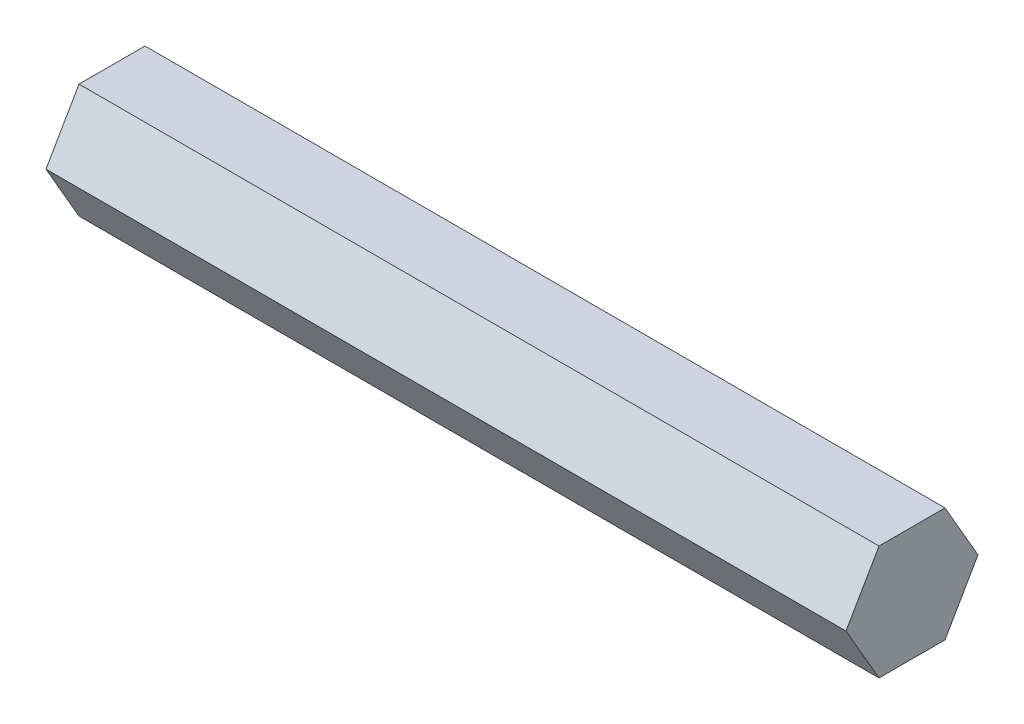
ISO-10303-21;
HEADER;
FILE_DESCRIPTION(('STEP AP214'),'2;1');
FILE_NAME('part.step','',(''),(''),'','','');
FILE_SCHEMA(('AUTOMOTIVE_DESIGN { 1 0 10303 214 1 1 1 1 }'));
ENDSEC;
DATA;
#1=APPLICATION_CONTEXT('core data for automotive mechanical design processes');
#2=APPLICATION_PROTOCOL_DEFINITION('international standard','automotive_design',2000,#1);
#3=PRODUCT_CONTEXT('',#1,'mechanical');
#4=PRODUCT('Part','Part','',(#3));
#5=PRODUCT_RELATED_PRODUCT_CATEGORY('part','',(#4));
#6=PRODUCT_DEFINITION_FORMATION('','',#4);
#7=PRODUCT_DEFINITION_CONTEXT('part definition',#1,'design');
#8=PRODUCT_DEFINITION('design','',#6,#7);
#9=PRODUCT_DEFINITION_SHAPE('','',#8);
#10=(LENGTH_UNIT() NAMED_UNIT(*) SI_UNIT(.MILLI.,.METRE.));
#11=(NAMED_UNIT(*) PLANE_ANGLE_UNIT() SI_UNIT($,.RADIAN.));
#12=(NAMED_UNIT(*) SI_UNIT($,.STERADIAN.) SOLID_ANGLE_UNIT());
#13=UNCERTAINTY_MEASURE_WITH_UNIT(LENGTH_MEASURE(1.E-05),#10,'distance_accuracy_value','');
#14=(GEOMETRIC_REPRESENTATION_CONTEXT(3) GLOBAL_UNCERTAINTY_ASSIGNED_CONTEXT((#13)) GLOBAL_UNIT_ASSIGNED_CONTEXT((#10,
#11,#12)) REPRESENTATION_CONTEXT('',''));
#15=CARTESIAN_POINT('',(0.,0.,0.));
#16=DIRECTION('',(0.,0.,1.));
#17=DIRECTION('',(1.,0.,0.));
#18=AXIS2_PLACEMENT_3D('',#15,#16,#17);
#19=CARTESIAN_POINT('',(88.9,6.34999999999996,3.6661742093542));
#20=DIRECTION('',(0.,-0.499999999999995,-0.866025403784441));
#21=DIRECTION('',(0.,0.866025403784442,-0.499999999999995));
#22=AXIS2_PLACEMENT_3D('',#19,#20,#21);
#23=PLANE('',#22);
#24=DIRECTION('',(0.,-0.866025403784442,0.499999999999995));
#25=VECTOR('',#24,1.);
#26=CARTESIAN_POINT('',(0.,6.34999999999996,3.6661742093542));
#27=LINE('',#26,#25);
#28=CARTESIAN_POINT('',(0.,6.34999999999996,3.6661742093542));
#29=VERTEX_POINT('',#28);
#30=CARTESIAN_POINT('',(0.,0.,7.33234841870825));
#31=VERTEX_POINT('',#30);
#32=EDGE_CURVE('E117',#29,#31,#27,.T.);
#33=ORIENTED_EDGE('',*,*,#32,.T.);
#34=DIRECTION('',(-1.,0.,0.));
#35=VECTOR('',#34,1.);
#36=CARTESIAN_POINT('',(88.9,0.,7.33234841870825));
#37=LINE('',#36,#35);
#38=CARTESIAN_POINT('',(88.9,0.,7.33234841870825));
#39=VERTEX_POINT('',#38);
#40=EDGE_CURVE('E11',#39,#31,#37,.T.);
#41=ORIENTED_EDGE('',*,*,#40,.F.);
#42=DIRECTION('',(0.,-0.866025403784442,0.499999999999995));
#43=VECTOR('',#42,1.);
#44=CARTESIAN_POINT('',(88.9,6.34999999999996,3.6661742093542));
#45=LINE('',#44,#43);
#46=CARTESIAN_POINT('',(88.9,6.34999999999996,3.6661742093542));
#47=VERTEX_POINT('',#46);
#48=EDGE_CURVE('E127',#47,#39,#45,.T.);
#49=ORIENTED_EDGE('',*,*,#48,.F.);
#50=DIRECTION('',(-1.,0.,0.));
#51=VECTOR('',#50,1.);
#52=CARTESIAN_POINT('',(88.9,6.34999999999996,3.6661742093542));
#53=LINE('',#52,#51);
#54=EDGE_CURVE('E113',#47,#29,#53,.T.);
#55=ORIENTED_EDGE('',*,*,#54,.T.);
#56=EDGE_LOOP('',(#33,#41,#49,#55));
#57=FACE_BOUND('',#56,.T.);
#58=ADVANCED_FACE('F33',(#57),#23,.F.);
#59=CARTESIAN_POINT('',(88.9,0.,7.33234841870825));
#60=DIRECTION('',(0.,0.500000000000001,-0.866025403784438));
#61=DIRECTION('',(0.,0.866025403784438,0.500000000000001));
#62=AXIS2_PLACEMENT_3D('',#59,#60,#61);
#63=PLANE('',#62);
#64=DIRECTION('',(0.,-0.866025403784438,-0.500000000000001));
#65=VECTOR('',#64,1.);
#66=CARTESIAN_POINT('',(0.,0.,7.33234841870825));
#67=LINE('',#66,#65);
#68=CARTESIAN_POINT('',(0.,-6.35000000000001,3.66617420935411));
#69=VERTEX_POINT('',#68);
#70=EDGE_CURVE('E120',#31,#69,#67,.T.);
#71=ORIENTED_EDGE('',*,*,#70,.T.);
#72=DIRECTION('',(-1.,0.,0.));
#73=VECTOR('',#72,1.);
#74=CARTESIAN_POINT('',(88.9,-6.35000000000001,3.66617420935411));
#75=LINE('',#74,#73);
#76=CARTESIAN_POINT('',(88.9,-6.35000000000001,3.66617420935411));
#77=VERTEX_POINT('',#76);
#78=EDGE_CURVE('E41',#77,#69,#75,.T.);
#79=ORIENTED_EDGE('',*,*,#78,.F.);
#80=DIRECTION('',(0.,-0.866025403784438,-0.500000000000001));
#81=VECTOR('',#80,1.);
#82=CARTESIAN_POINT('',(88.9,0.,7.33234841870825));
#83=LINE('',#82,#81);
#84=EDGE_CURVE('E86',#39,#77,#83,.T.);
#85=ORIENTED_EDGE('',*,*,#84,.F.);
#86=ORIENTED_EDGE('',*,*,#40,.T.);
#87=EDGE_LOOP('',(#71,#79,#85,#86));
#88=FACE_BOUND('',#87,.T.);
#89=ADVANCED_FACE('F151',(#88),#63,.F.);
#90=CARTESIAN_POINT('',(88.9,-6.35000000000001,3.66617420935411));
#91=DIRECTION('',(0.,1.,0.));
#92=DIRECTION('',(0.,0.,1.));
#93=AXIS2_PLACEMENT_3D('',#90,#91,#92);
#94=PLANE('',#93);
#95=DIRECTION('',(0.,0.,-1.));
#96=VECTOR('',#95,1.);
#97=CARTESIAN_POINT('',(0.,-6.35000000000001,3.66617420935411));
#98=LINE('',#97,#96);
#99=CARTESIAN_POINT('',(0.,-6.34999999999999,-3.66617420935416));
#100=VERTEX_POINT('',#99);
#101=EDGE_CURVE('E122',#69,#100,#98,.T.);
#102=ORIENTED_EDGE('',*,*,#101,.T.);
#103=DIRECTION('',(-1.,0.,0.));
#104=VECTOR('',#103,1.);
#105=CARTESIAN_POINT('',(88.9,-6.34999999999999,-3.66617420935416));
#106=LINE('',#105,#104);
#107=CARTESIAN_POINT('',(88.9,-6.34999999999999,-3.66617420935416));
#108=VERTEX_POINT('',#107);
#109=EDGE_CURVE('E108',#108,#100,#106,.T.);
#110=ORIENTED_EDGE('',*,*,#109,.F.);
#111=DIRECTION('',(0.,0.,-1.));
#112=VECTOR('',#111,1.);
#113=CARTESIAN_POINT('',(88.9,-6.35000000000001,3.66617420935411));
#114=LINE('',#113,#112);
#115=EDGE_CURVE('E99',#77,#108,#114,.T.);
#116=ORIENTED_EDGE('',*,*,#115,.F.);
#117=ORIENTED_EDGE('',*,*,#78,.T.);
#118=EDGE_LOOP('',(#102,#110,#116,#117));
#119=FACE_BOUND('',#118,.T.);
#120=ADVANCED_FACE('F133',(#119),#94,.F.);
#121=CARTESIAN_POINT('',(88.9,-6.34999999999999,-3.66617420935416));
#122=DIRECTION('',(0.,0.499999999999995,0.866025403784441));
#123=DIRECTION('',(0.,-0.866025403784442,0.499999999999995));
#124=AXIS2_PLACEMENT_3D('',#121,#122,#123);
#125=PLANE('',#124);
#126=DIRECTION('',(0.,0.866025403784442,-0.499999999999995));
#127=VECTOR('',#126,1.);
#128=CARTESIAN_POINT('',(0.,-6.34999999999999,-3.66617420935416));
#129=LINE('',#128,#127);
#130=CARTESIAN_POINT('',(0.,0.,-7.33234841870825));
#131=VERTEX_POINT('',#130);
#132=EDGE_CURVE('E107',#100,#131,#129,.T.);
#133=ORIENTED_EDGE('',*,*,#132,.T.);
#134=DIRECTION('',(-1.,0.,0.));
#135=VECTOR('',#134,1.);
#136=CARTESIAN_POINT('',(88.9,0.,-7.33234841870825));
#137=LINE('',#136,#135);
#138=CARTESIAN_POINT('',(88.9,0.,-7.33234841870825));
#139=VERTEX_POINT('',#138);
#140=EDGE_CURVE('E104',#139,#131,#137,.T.);
#141=ORIENTED_EDGE('',*,*,#140,.F.);
#142=DIRECTION('',(0.,0.866025403784442,-0.499999999999995));
#143=VECTOR('',#142,1.);
#144=CARTESIAN_POINT('',(88.9,-6.34999999999999,-3.66617420935416));
#145=LINE('',#144,#143);
#146=EDGE_CURVE('E93',#108,#139,#145,.T.);
#147=ORIENTED_EDGE('',*,*,#146,.F.);
#148=ORIENTED_EDGE('',*,*,#109,.T.);
#149=EDGE_LOOP('',(#133,#141,#147,#148));
#150=FACE_BOUND('',#149,.T.);
#151=ADVANCED_FACE('F105',(#150),#125,.F.);
#152=CARTESIAN_POINT('',(88.9,0.,-7.33234841870825));
#153=DIRECTION('',(0.,-0.500000000000007,0.866025403784435));
#154=DIRECTION('',(0.,-0.866025403784435,-0.500000000000007));
#155=AXIS2_PLACEMENT_3D('',#152,#153,#154);
#156=PLANE('',#155);
#157=DIRECTION('',(0.,0.866025403784435,0.500000000000007));
#158=VECTOR('',#157,1.);
#159=CARTESIAN_POINT('',(0.,0.,-7.33234841870825));
#160=LINE('',#159,#158);
#161=CARTESIAN_POINT('',(0.,6.35000000000004,-3.66617420935407));
#162=VERTEX_POINT('',#161);
#163=EDGE_CURVE('E72',#131,#162,#160,.T.);
#164=ORIENTED_EDGE('',*,*,#163,.T.);
#165=DIRECTION('',(-1.,0.,0.));
#166=VECTOR('',#165,1.);
#167=CARTESIAN_POINT('',(88.9,6.35000000000004,-3.66617420935407));
#168=LINE('',#167,#166);
#169=CARTESIAN_POINT('',(88.9,6.35000000000004,-3.66617420935407));
#170=VERTEX_POINT('',#169);
#171=EDGE_CURVE('E109',#170,#162,#168,.T.);
#172=ORIENTED_EDGE('',*,*,#171,.F.);
#173=DIRECTION('',(0.,0.866025403784435,0.500000000000007));
#174=VECTOR('',#173,1.);
#175=CARTESIAN_POINT('',(88.9,0.,-7.33234841870825));
#176=LINE('',#175,#174);
#177=EDGE_CURVE('E97',#139,#170,#176,.T.);
#178=ORIENTED_EDGE('',*,*,#177,.F.);
#179=ORIENTED_EDGE('',*,*,#140,.T.);
#180=EDGE_LOOP('',(#164,#172,#178,#179));
#181=FACE_BOUND('',#180,.T.);
#182=ADVANCED_FACE('F111',(#181),#156,.F.);
#183=CARTESIAN_POINT('',(88.9,6.35000000000004,-3.66617420935407));
#184=DIRECTION('',(0.,-1.,0.));
#185=DIRECTION('',(0.,0.,-1.));
#186=AXIS2_PLACEMENT_3D('',#183,#184,#185);
#187=PLANE('',#186);
#188=DIRECTION('',(0.,0.,1.));
#189=VECTOR('',#188,1.);
#190=CARTESIAN_POINT('',(0.,6.35000000000004,-3.66617420935407));
#191=LINE('',#190,#189);
#192=EDGE_CURVE('E78',#162,#29,#191,.T.);
#193=ORIENTED_EDGE('',*,*,#192,.T.);
#194=ORIENTED_EDGE('',*,*,#54,.F.);
#195=DIRECTION('',(0.,0.,1.));
#196=VECTOR('',#195,1.);
#197=CARTESIAN_POINT('',(88.9,6.35000000000004,-3.66617420935407));
#198=LINE('',#197,#196);
#199=EDGE_CURVE('E49',#170,#47,#198,.T.);
#200=ORIENTED_EDGE('',*,*,#199,.F.);
#201=ORIENTED_EDGE('',*,*,#171,.T.);
#202=EDGE_LOOP('',(#193,#194,#200,#201));
#203=FACE_BOUND('',#202,.T.);
#204=ADVANCED_FACE('F140',(#203),#187,.F.);
#205=CARTESIAN_POINT('',(88.9,0.,0.));
#206=DIRECTION('',(1.,0.,0.));
#207=DIRECTION('',(0.,0.,-1.));
#208=AXIS2_PLACEMENT_3D('',#205,#206,#207);
#209=PLANE('',#208);
#210=ORIENTED_EDGE('',*,*,#48,.T.);
#211=ORIENTED_EDGE('',*,*,#84,.T.);
#212=ORIENTED_EDGE('',*,*,#115,.T.);
#213=ORIENTED_EDGE('',*,*,#146,.T.);
#214=ORIENTED_EDGE('',*,*,#177,.T.);
#215=ORIENTED_EDGE('',*,*,#199,.T.);
#216=EDGE_LOOP('',(#210,#211,#212,#213,#214,#215));
#217=FACE_BOUND('',#216,.T.);
#218=ADVANCED_FACE('F95',(#217),#209,.T.);
#219=CARTESIAN_POINT('',(0.,0.,0.));
#220=DIRECTION('',(1.,0.,0.));
#221=DIRECTION('',(0.,0.,-1.));
#222=AXIS2_PLACEMENT_3D('',#219,#220,#221);
#223=PLANE('',#222);
#224=ORIENTED_EDGE('',*,*,#32,.F.);
#225=ORIENTED_EDGE('',*,*,#192,.F.);
#226=ORIENTED_EDGE('',*,*,#163,.F.);
#227=ORIENTED_EDGE('',*,*,#132,.F.);
#228=ORIENTED_EDGE('',*,*,#101,.F.);
#229=ORIENTED_EDGE('',*,*,#70,.F.);
#230=EDGE_LOOP('',(#224,#225,#226,#227,#228,#229));
#231=FACE_BOUND('',#230,.T.);
#232=ADVANCED_FACE('F136',(#231),#223,.F.);
#233=CLOSED_SHELL('',(#58,#89,#120,#151,#182,#204,#218,#232));
#234=MANIFOLD_SOLID_BREP('B2',#233);
#235=ADVANCED_BREP_SHAPE_REPRESENTATION('',(#18,#234),#14);
#236=SHAPE_DEFINITION_REPRESENTATION(#9,#235);
ENDSEC;
END-ISO-10303-21;
